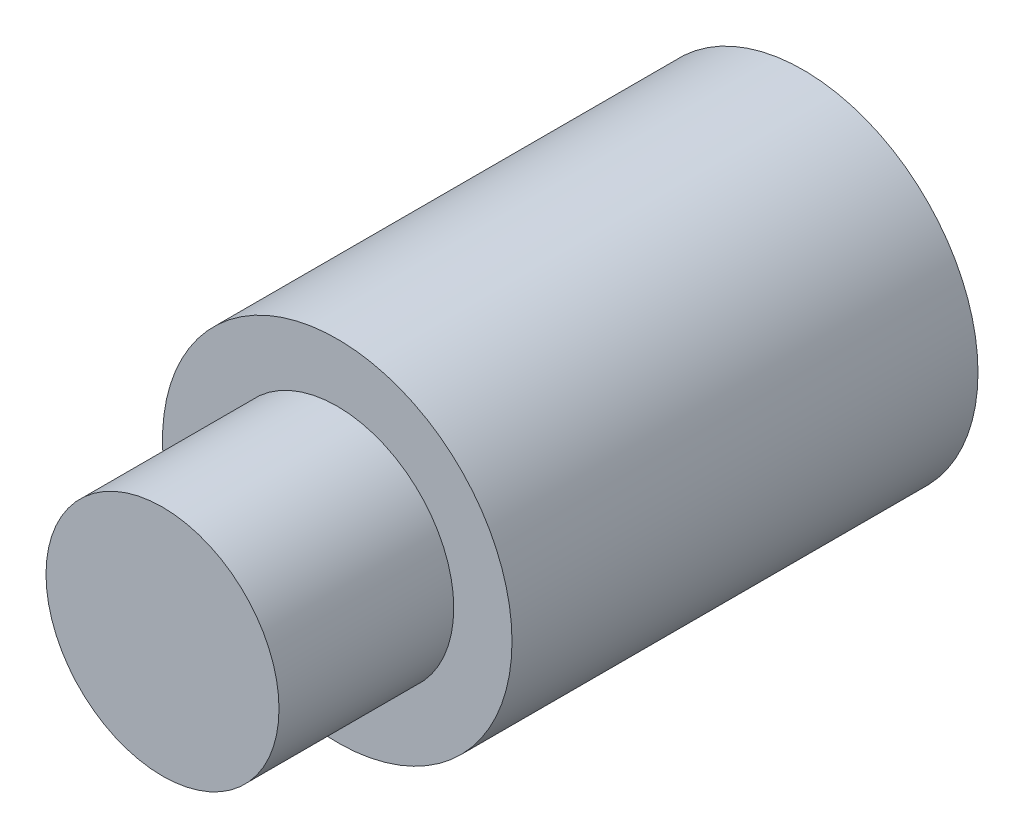
ISO-10303-21;
HEADER;
FILE_DESCRIPTION(('STEP AP214'),'2;1');
FILE_NAME('part.step','',(''),(''),'','','');
FILE_SCHEMA(('AUTOMOTIVE_DESIGN { 1 0 10303 214 1 1 1 1 }'));
ENDSEC;
DATA;
#1=APPLICATION_CONTEXT('core data for automotive mechanical design processes');
#2=APPLICATION_PROTOCOL_DEFINITION('international standard','automotive_design',2000,#1);
#3=PRODUCT_CONTEXT('',#1,'mechanical');
#4=PRODUCT('Part','Part','',(#3));
#5=PRODUCT_RELATED_PRODUCT_CATEGORY('part','',(#4));
#6=PRODUCT_DEFINITION_FORMATION('','',#4);
#7=PRODUCT_DEFINITION_CONTEXT('part definition',#1,'design');
#8=PRODUCT_DEFINITION('design','',#6,#7);
#9=PRODUCT_DEFINITION_SHAPE('','',#8);
#10=(LENGTH_UNIT() NAMED_UNIT(*) SI_UNIT(.MILLI.,.METRE.));
#11=(NAMED_UNIT(*) PLANE_ANGLE_UNIT() SI_UNIT($,.RADIAN.));
#12=(NAMED_UNIT(*) SI_UNIT($,.STERADIAN.) SOLID_ANGLE_UNIT());
#13=UNCERTAINTY_MEASURE_WITH_UNIT(LENGTH_MEASURE(1.E-05),#10,'distance_accuracy_value','');
#14=(GEOMETRIC_REPRESENTATION_CONTEXT(3) GLOBAL_UNCERTAINTY_ASSIGNED_CONTEXT((#13)) GLOBAL_UNIT_ASSIGNED_CONTEXT((#10,
#11,#12)) REPRESENTATION_CONTEXT('',''));
#15=CARTESIAN_POINT('',(0.,0.,0.));
#16=DIRECTION('',(0.,0.,1.));
#17=DIRECTION('',(1.,0.,0.));
#18=AXIS2_PLACEMENT_3D('',#15,#16,#17);
#19=CARTESIAN_POINT('',(0.,38.1,50.8));
#20=DIRECTION('',(0.,0.,-1.));
#21=DIRECTION('',(-1.,0.,0.));
#22=AXIS2_PLACEMENT_3D('',#19,#20,#21);
#23=CYLINDRICAL_SURFACE('',#22,19.05);
#24=CARTESIAN_POINT('',(0.,38.1,50.8));
#25=DIRECTION('',(0.,0.,1.));
#26=DIRECTION('',(1.,0.,0.));
#27=AXIS2_PLACEMENT_3D('',#24,#25,#26);
#28=CIRCLE('',#27,19.05);
#29=CARTESIAN_POINT('',(19.05,38.1,50.8));
#30=VERTEX_POINT('',#29);
#31=EDGE_CURVE('E10',#30,#30,#28,.T.);
#32=ORIENTED_EDGE('',*,*,#31,.F.);
#33=EDGE_LOOP('',(#32));
#34=FACE_BOUND('',#33,.T.);
#35=CARTESIAN_POINT('',(0.,38.1,0.));
#36=DIRECTION('',(0.,0.,1.));
#37=DIRECTION('',(1.,0.,0.));
#38=AXIS2_PLACEMENT_3D('',#35,#36,#37);
#39=CIRCLE('',#38,19.05);
#40=CARTESIAN_POINT('',(19.05,38.1,0.));
#41=VERTEX_POINT('',#40);
#42=EDGE_CURVE('E34',#41,#41,#39,.T.);
#43=ORIENTED_EDGE('',*,*,#42,.T.);
#44=EDGE_LOOP('',(#43));
#45=FACE_BOUND('',#44,.T.);
#46=ADVANCED_FACE('F31',(#34,#45),#23,.T.);
#47=CARTESIAN_POINT('',(0.,38.1,50.8));
#48=DIRECTION('',(0.,0.,1.));
#49=DIRECTION('',(1.,0.,0.));
#50=AXIS2_PLACEMENT_3D('',#47,#48,#49);
#51=PLANE('',#50);
#52=CARTESIAN_POINT('',(0.,38.1,50.8));
#53=DIRECTION('',(0.,0.,1.));
#54=DIRECTION('',(1.,0.,0.));
#55=AXIS2_PLACEMENT_3D('',#52,#53,#54);
#56=CIRCLE('',#55,12.7);
#57=CARTESIAN_POINT('',(-12.7,38.1,50.8));
#58=VERTEX_POINT('',#57);
#59=EDGE_CURVE('E43',#58,#58,#56,.T.);
#60=ORIENTED_EDGE('',*,*,#59,.F.);
#61=EDGE_LOOP('',(#60));
#62=FACE_BOUND('',#61,.T.);
#63=ORIENTED_EDGE('',*,*,#31,.T.);
#64=EDGE_LOOP('',(#63));
#65=FACE_BOUND('',#64,.T.);
#66=ADVANCED_FACE('F58',(#62,#65),#51,.T.);
#67=CARTESIAN_POINT('',(0.,38.1,0.));
#68=DIRECTION('',(0.,0.,1.));
#69=DIRECTION('',(1.,0.,0.));
#70=AXIS2_PLACEMENT_3D('',#67,#68,#69);
#71=PLANE('',#70);
#72=ORIENTED_EDGE('',*,*,#42,.F.);
#73=EDGE_LOOP('',(#72));
#74=FACE_BOUND('',#73,.T.);
#75=ADVANCED_FACE('F54',(#74),#71,.F.);
#76=CARTESIAN_POINT('',(0.,38.1,69.85));
#77=DIRECTION('',(0.,0.,-1.));
#78=DIRECTION('',(-1.,0.,0.));
#79=AXIS2_PLACEMENT_3D('',#76,#77,#78);
#80=CYLINDRICAL_SURFACE('',#79,12.7);
#81=CARTESIAN_POINT('',(0.,38.1,69.85));
#82=DIRECTION('',(0.,0.,1.));
#83=DIRECTION('',(1.,0.,0.));
#84=AXIS2_PLACEMENT_3D('',#81,#82,#83);
#85=CIRCLE('',#84,12.7);
#86=CARTESIAN_POINT('',(-12.7,38.1,69.85));
#87=VERTEX_POINT('',#86);
#88=EDGE_CURVE('E41',#87,#87,#85,.T.);
#89=CARTESIAN_POINT('',(-12.7,38.1,69.85));
#90=CARTESIAN_POINT('',(-12.7,38.1,69.6515625));
#91=CARTESIAN_POINT('',(-12.7,38.1,69.453125));
#92=CARTESIAN_POINT('',(-12.7,38.1,69.05625));
#93=CARTESIAN_POINT('',(-12.7,38.1,68.8578125));
#94=CARTESIAN_POINT('',(-12.7,38.1,68.4609375));
#95=CARTESIAN_POINT('',(-12.7,38.1,68.2625));
#96=CARTESIAN_POINT('',(-12.7,38.1,67.865625));
#97=CARTESIAN_POINT('',(-12.7,38.1,67.6671875));
#98=CARTESIAN_POINT('',(-12.7,38.1,67.2703125));
#99=CARTESIAN_POINT('',(-12.7,38.1,67.071875));
#100=CARTESIAN_POINT('',(-12.7,38.1,66.675));
#101=CARTESIAN_POINT('',(-12.7,38.1,66.4765625));
#102=CARTESIAN_POINT('',(-12.7,38.1,66.0796875));
#103=CARTESIAN_POINT('',(-12.7,38.1,65.88125));
#104=CARTESIAN_POINT('',(-12.7,38.1,65.484375));
#105=CARTESIAN_POINT('',(-12.7,38.1,65.2859375));
#106=CARTESIAN_POINT('',(-12.7,38.1,64.8890625));
#107=CARTESIAN_POINT('',(-12.7,38.1,64.690625));
#108=CARTESIAN_POINT('',(-12.7,38.1,64.29375));
#109=CARTESIAN_POINT('',(-12.7,38.1,64.0953125));
#110=CARTESIAN_POINT('',(-12.7,38.1,63.6984375));
#111=CARTESIAN_POINT('',(-12.7,38.1,63.5));
#112=CARTESIAN_POINT('',(-12.7,38.1,63.103125));
#113=CARTESIAN_POINT('',(-12.7,38.1,62.9046875));
#114=CARTESIAN_POINT('',(-12.7,38.1,62.5078125));
#115=CARTESIAN_POINT('',(-12.7,38.1,62.309375));
#116=CARTESIAN_POINT('',(-12.7,38.1,61.9125));
#117=CARTESIAN_POINT('',(-12.7,38.1,61.7140625));
#118=CARTESIAN_POINT('',(-12.7,38.1,61.3171875));
#119=CARTESIAN_POINT('',(-12.7,38.1,61.11875));
#120=CARTESIAN_POINT('',(-12.7,38.1,60.721875));
#121=CARTESIAN_POINT('',(-12.7,38.1,60.5234375));
#122=CARTESIAN_POINT('',(-12.7,38.1,60.1265625));
#123=CARTESIAN_POINT('',(-12.7,38.1,59.928125));
#124=CARTESIAN_POINT('',(-12.7,38.1,59.53125));
#125=CARTESIAN_POINT('',(-12.7,38.1,59.3328125));
#126=CARTESIAN_POINT('',(-12.7,38.1,58.9359375));
#127=CARTESIAN_POINT('',(-12.7,38.1,58.7375));
#128=CARTESIAN_POINT('',(-12.7,38.1,58.340625));
#129=CARTESIAN_POINT('',(-12.7,38.1,58.1421875));
#130=CARTESIAN_POINT('',(-12.7,38.1,57.7453125));
#131=CARTESIAN_POINT('',(-12.7,38.1,57.546875));
#132=CARTESIAN_POINT('',(-12.7,38.1,57.15));
#133=CARTESIAN_POINT('',(-12.7,38.1,56.9515625));
#134=CARTESIAN_POINT('',(-12.7,38.1,56.5546875));
#135=CARTESIAN_POINT('',(-12.7,38.1,56.35625));
#136=CARTESIAN_POINT('',(-12.7,38.1,55.959375));
#137=CARTESIAN_POINT('',(-12.7,38.1,55.7609375));
#138=CARTESIAN_POINT('',(-12.7,38.1,55.3640625));
#139=CARTESIAN_POINT('',(-12.7,38.1,55.165625));
#140=CARTESIAN_POINT('',(-12.7,38.1,54.76875));
#141=CARTESIAN_POINT('',(-12.7,38.1,54.5703125));
#142=CARTESIAN_POINT('',(-12.7,38.1,54.1734375));
#143=CARTESIAN_POINT('',(-12.7,38.1,53.975));
#144=CARTESIAN_POINT('',(-12.7,38.1,53.578125));
#145=CARTESIAN_POINT('',(-12.7,38.1,53.3796875));
#146=CARTESIAN_POINT('',(-12.7,38.1,52.9828125));
#147=CARTESIAN_POINT('',(-12.7,38.1,52.784375));
#148=CARTESIAN_POINT('',(-12.7,38.1,52.3875));
#149=CARTESIAN_POINT('',(-12.7,38.1,52.1890625));
#150=CARTESIAN_POINT('',(-12.7,38.1,51.7921875));
#151=CARTESIAN_POINT('',(-12.7,38.1,51.59375));
#152=CARTESIAN_POINT('',(-12.7,38.1,51.196875));
#153=CARTESIAN_POINT('',(-12.7,38.1,50.9984375));
#154=CARTESIAN_POINT('',(-12.7,38.1,50.8));
#155=B_SPLINE_CURVE_WITH_KNOTS('',3,(#89,#90,#91,#92,#93,#94,#95,#96,#97,#98,#99,#100,#101,#102,
#103,#104,#105,#106,#107,#108,#109,#110,#111,#112,#113,#114,#115,#116,#117,#118,#119,#120,#121,
#122,#123,#124,#125,#126,#127,#128,#129,#130,#131,#132,#133,#134,#135,#136,#137,#138,#139,#140,
#141,#142,#143,#144,#145,#146,#147,#148,#149,#150,#151,#152,#153,#154),.UNSPECIFIED.,.F.,.F.,(4,
2,2,2,2,2,2,2,2,2,2,2,2,2,2,2,2,2,2,2,2,2,2,2,2,2,2,2,2,2,2,2,4),(0.,0.5953125,1.190625,
1.7859375,2.38125,2.9765625,3.571875,4.1671875,4.7625,5.3578125,5.953125,6.5484375,7.14375,
7.7390625,8.334375,8.92968750000001,9.52500000000001,10.1203125,10.715625,11.3109375,11.90625,
12.5015625,13.096875,13.6921875,14.2875,14.8828125,15.478125,16.0734375,16.66875,17.2640625,
17.859375,18.4546875,19.05),.UNSPECIFIED.);
#156=EDGE_CURVE('BSEAM51',#87,#58,#155,.T.);
#157=ORIENTED_EDGE('',*,*,#88,.F.);
#158=ORIENTED_EDGE('',*,*,#59,.T.);
#159=ORIENTED_EDGE('',*,*,#156,.T.);
#160=ORIENTED_EDGE('',*,*,#156,.F.);
#161=EDGE_LOOP('',(#157,#159,#158,#160));
#162=FACE_BOUND('',#161,.T.);
#163=ADVANCED_FACE('F51',(#162),#80,.T.);
#164=CARTESIAN_POINT('',(0.,38.1,69.85));
#165=DIRECTION('',(0.,0.,1.));
#166=DIRECTION('',(1.,0.,0.));
#167=AXIS2_PLACEMENT_3D('',#164,#165,#166);
#168=PLANE('',#167);
#169=ORIENTED_EDGE('',*,*,#88,.T.);
#170=EDGE_LOOP('',(#169));
#171=FACE_BOUND('',#170,.T.);
#172=ADVANCED_FACE('F49',(#171),#168,.T.);
#173=CLOSED_SHELL('',(#46,#66,#75,#163,#172));
#174=MANIFOLD_SOLID_BREP('B2',#173);
#175=ADVANCED_BREP_SHAPE_REPRESENTATION('',(#18,#174),#14);
#176=SHAPE_DEFINITION_REPRESENTATION(#9,#175);
ENDSEC;
END-ISO-10303-21;
